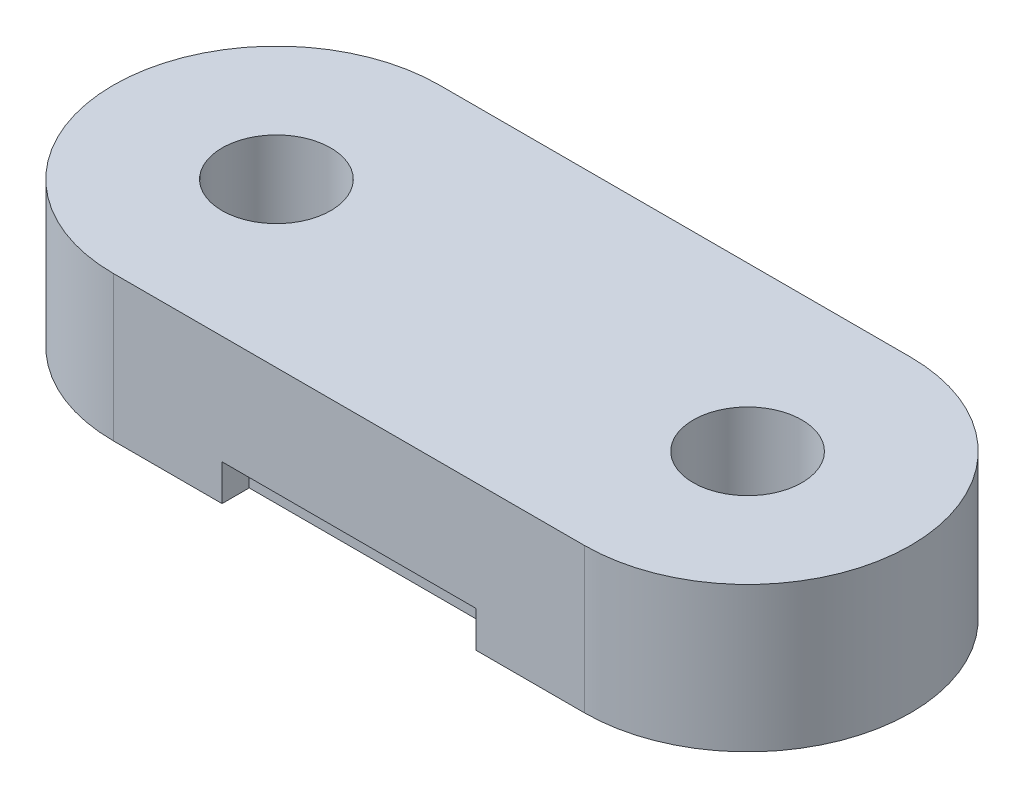
ISO-10303-21;
HEADER;
FILE_DESCRIPTION(('STEP AP214'),'2;1');
FILE_NAME('part.step','',(''),(''),'','','');
FILE_SCHEMA(('AUTOMOTIVE_DESIGN { 1 0 10303 214 1 1 1 1 }'));
ENDSEC;
DATA;
#1=APPLICATION_CONTEXT('core data for automotive mechanical design processes');
#2=APPLICATION_PROTOCOL_DEFINITION('international standard','automotive_design',2000,#1);
#3=PRODUCT_CONTEXT('',#1,'mechanical');
#4=PRODUCT('Part','Part','',(#3));
#5=PRODUCT_RELATED_PRODUCT_CATEGORY('part','',(#4));
#6=PRODUCT_DEFINITION_FORMATION('','',#4);
#7=PRODUCT_DEFINITION_CONTEXT('part definition',#1,'design');
#8=PRODUCT_DEFINITION('design','',#6,#7);
#9=PRODUCT_DEFINITION_SHAPE('','',#8);
#10=(LENGTH_UNIT() NAMED_UNIT(*) SI_UNIT(.MILLI.,.METRE.));
#11=(NAMED_UNIT(*) PLANE_ANGLE_UNIT() SI_UNIT($,.RADIAN.));
#12=(NAMED_UNIT(*) SI_UNIT($,.STERADIAN.) SOLID_ANGLE_UNIT());
#13=UNCERTAINTY_MEASURE_WITH_UNIT(LENGTH_MEASURE(1.E-05),#10,'distance_accuracy_value','');
#14=(GEOMETRIC_REPRESENTATION_CONTEXT(3) GLOBAL_UNCERTAINTY_ASSIGNED_CONTEXT((#13)) GLOBAL_UNIT_ASSIGNED_CONTEXT((#10,
#11,#12)) REPRESENTATION_CONTEXT('',''));
#15=CARTESIAN_POINT('',(0.,0.,0.));
#16=DIRECTION('',(0.,0.,1.));
#17=DIRECTION('',(1.,0.,0.));
#18=AXIS2_PLACEMENT_3D('',#15,#16,#17);
#19=CARTESIAN_POINT('',(-6.5,0.,0.));
#20=DIRECTION('',(0.,1.,0.));
#21=DIRECTION('',(0.,0.,1.));
#22=AXIS2_PLACEMENT_3D('',#19,#20,#21);
#23=PLANE('',#22);
#24=DIRECTION('',(1.,0.,0.));
#25=VECTOR('',#24,1.);
#26=CARTESIAN_POINT('',(0.,0.,3.75));
#27=LINE('',#26,#25);
#28=CARTESIAN_POINT('',(-3.5,0.,3.75));
#29=VERTEX_POINT('',#28);
#30=CARTESIAN_POINT('',(3.5,0.,3.75));
#31=VERTEX_POINT('',#30);
#32=EDGE_CURVE('E192',#29,#31,#27,.T.);
#33=ORIENTED_EDGE('',*,*,#32,.F.);
#34=DIRECTION('',(0.,0.,-1.));
#35=VECTOR('',#34,1.);
#36=CARTESIAN_POINT('',(-3.49999999999999,0.,-18.6299313016061));
#37=LINE('',#36,#35);
#38=CARTESIAN_POINT('',(-3.5,0.,4.5));
#39=VERTEX_POINT('',#38);
#40=EDGE_CURVE('E175',#39,#29,#37,.T.);
#41=ORIENTED_EDGE('',*,*,#40,.F.);
#42=DIRECTION('',(1.,0.,0.));
#43=VECTOR('',#42,1.);
#44=CARTESIAN_POINT('',(-6.5,0.,4.5));
#45=LINE('',#44,#43);
#46=CARTESIAN_POINT('',(-6.5,0.,4.5));
#47=VERTEX_POINT('',#46);
#48=EDGE_CURVE('E319',#47,#39,#45,.T.);
#49=ORIENTED_EDGE('',*,*,#48,.F.);
#50=CARTESIAN_POINT('',(-6.5,0.,0.));
#51=DIRECTION('',(0.,1.,0.));
#52=DIRECTION('',(0.,0.,1.));
#53=AXIS2_PLACEMENT_3D('',#50,#51,#52);
#54=CIRCLE('',#53,4.5);
#55=CARTESIAN_POINT('',(-6.5,0.,-4.5));
#56=VERTEX_POINT('',#55);
#57=EDGE_CURVE('E302',#56,#47,#54,.T.);
#58=ORIENTED_EDGE('',*,*,#57,.F.);
#59=DIRECTION('',(-1.,0.,0.));
#60=VECTOR('',#59,1.);
#61=CARTESIAN_POINT('',(-6.5,0.,-4.5));
#62=LINE('',#61,#60);
#63=CARTESIAN_POINT('',(-3.5,0.,-4.5));
#64=VERTEX_POINT('',#63);
#65=EDGE_CURVE('E324',#64,#56,#62,.T.);
#66=ORIENTED_EDGE('',*,*,#65,.F.);
#67=DIRECTION('',(0.,0.,-1.));
#68=VECTOR('',#67,1.);
#69=CARTESIAN_POINT('',(-3.49999999999999,0.,-18.6299313016061));
#70=LINE('',#69,#68);
#71=CARTESIAN_POINT('',(-3.5,0.,-3.75));
#72=VERTEX_POINT('',#71);
#73=EDGE_CURVE('E279',#72,#64,#70,.T.);
#74=ORIENTED_EDGE('',*,*,#73,.F.);
#75=DIRECTION('',(1.,0.,0.));
#76=VECTOR('',#75,1.);
#77=CARTESIAN_POINT('',(0.,0.,-3.75));
#78=LINE('',#77,#76);
#79=CARTESIAN_POINT('',(3.5,0.,-3.75));
#80=VERTEX_POINT('',#79);
#81=EDGE_CURVE('E258',#72,#80,#78,.T.);
#82=ORIENTED_EDGE('',*,*,#81,.T.);
#83=DIRECTION('',(0.,0.,-1.));
#84=VECTOR('',#83,1.);
#85=CARTESIAN_POINT('',(3.5,0.,-18.6299313016061));
#86=LINE('',#85,#84);
#87=CARTESIAN_POINT('',(3.5,0.,-4.5));
#88=VERTEX_POINT('',#87);
#89=EDGE_CURVE('E269',#80,#88,#86,.T.);
#90=ORIENTED_EDGE('',*,*,#89,.T.);
#91=CARTESIAN_POINT('',(6.5,0.,-4.5));
#92=VERTEX_POINT('',#91);
#93=EDGE_CURVE('E309',#92,#88,#62,.T.);
#94=ORIENTED_EDGE('',*,*,#93,.F.);
#95=CARTESIAN_POINT('',(6.5,0.,0.));
#96=DIRECTION('',(0.,1.,0.));
#97=DIRECTION('',(0.,0.,1.));
#98=AXIS2_PLACEMENT_3D('',#95,#96,#97);
#99=CIRCLE('',#98,4.5);
#100=CARTESIAN_POINT('',(6.5,0.,4.5));
#101=VERTEX_POINT('',#100);
#102=EDGE_CURVE('E322',#101,#92,#99,.T.);
#103=ORIENTED_EDGE('',*,*,#102,.F.);
#104=CARTESIAN_POINT('',(3.5,0.,4.5));
#105=VERTEX_POINT('',#104);
#106=EDGE_CURVE('E318',#105,#101,#45,.T.);
#107=ORIENTED_EDGE('',*,*,#106,.F.);
#108=DIRECTION('',(0.,0.,-1.));
#109=VECTOR('',#108,1.);
#110=CARTESIAN_POINT('',(3.5,0.,-18.6299313016061));
#111=LINE('',#110,#109);
#112=EDGE_CURVE('E189',#105,#31,#111,.T.);
#113=ORIENTED_EDGE('',*,*,#112,.T.);
#114=EDGE_LOOP('',(#33,#41,#49,#58,#66,#74,#82,#90,#94,#103,#107,#113));
#115=FACE_BOUND('',#114,.T.);
#116=CARTESIAN_POINT('',(6.5,0.,0.));
#117=DIRECTION('',(0.,1.,0.));
#118=DIRECTION('',(0.,0.,1.));
#119=AXIS2_PLACEMENT_3D('',#116,#117,#118);
#120=CIRCLE('',#119,1.5);
#121=CARTESIAN_POINT('',(6.5,0.,1.5));
#122=VERTEX_POINT('',#121);
#123=EDGE_CURVE('E296',#122,#122,#120,.T.);
#124=ORIENTED_EDGE('',*,*,#123,.T.);
#125=EDGE_LOOP('',(#124));
#126=FACE_BOUND('',#125,.T.);
#127=CARTESIAN_POINT('',(-6.5,0.,0.));
#128=DIRECTION('',(0.,1.,0.));
#129=DIRECTION('',(0.,0.,1.));
#130=AXIS2_PLACEMENT_3D('',#127,#128,#129);
#131=CIRCLE('',#130,1.5);
#132=CARTESIAN_POINT('',(-6.5,0.,1.5));
#133=VERTEX_POINT('',#132);
#134=EDGE_CURVE('E286',#133,#133,#131,.T.);
#135=ORIENTED_EDGE('',*,*,#134,.T.);
#136=EDGE_LOOP('',(#135));
#137=FACE_BOUND('',#136,.T.);
#138=DIRECTION('',(1.,0.,0.));
#139=VECTOR('',#138,1.);
#140=CARTESIAN_POINT('',(0.,0.,-2.25));
#141=LINE('',#140,#139);
#142=CARTESIAN_POINT('',(-3.5,0.,-2.25));
#143=VERTEX_POINT('',#142);
#144=CARTESIAN_POINT('',(3.5,0.,-2.25));
#145=VERTEX_POINT('',#144);
#146=EDGE_CURVE('E248',#143,#145,#141,.T.);
#147=ORIENTED_EDGE('',*,*,#146,.F.);
#148=DIRECTION('',(0.,0.,-1.));
#149=VECTOR('',#148,1.);
#150=CARTESIAN_POINT('',(-3.49999999999999,0.,-18.6299313016061));
#151=LINE('',#150,#149);
#152=CARTESIAN_POINT('',(-3.5,0.,-0.750000000000001));
#153=VERTEX_POINT('',#152);
#154=EDGE_CURVE('E229',#153,#143,#151,.T.);
#155=ORIENTED_EDGE('',*,*,#154,.F.);
#156=DIRECTION('',(1.,0.,0.));
#157=VECTOR('',#156,1.);
#158=CARTESIAN_POINT('',(0.,0.,-0.750000000000001));
#159=LINE('',#158,#157);
#160=CARTESIAN_POINT('',(3.5,0.,-0.750000000000001));
#161=VERTEX_POINT('',#160);
#162=EDGE_CURVE('E239',#153,#161,#159,.T.);
#163=ORIENTED_EDGE('',*,*,#162,.T.);
#164=DIRECTION('',(0.,0.,-1.));
#165=VECTOR('',#164,1.);
#166=CARTESIAN_POINT('',(3.5,0.,-18.6299313016061));
#167=LINE('',#166,#165);
#168=EDGE_CURVE('E251',#161,#145,#167,.T.);
#169=ORIENTED_EDGE('',*,*,#168,.T.);
#170=EDGE_LOOP('',(#147,#155,#163,#169));
#171=FACE_BOUND('',#170,.T.);
#172=DIRECTION('',(1.,0.,0.));
#173=VECTOR('',#172,1.);
#174=CARTESIAN_POINT('',(0.,0.,2.25));
#175=LINE('',#174,#173);
#176=CARTESIAN_POINT('',(-3.5,0.,2.25));
#177=VERTEX_POINT('',#176);
#178=CARTESIAN_POINT('',(3.5,0.,2.25));
#179=VERTEX_POINT('',#178);
#180=EDGE_CURVE('E54',#177,#179,#175,.T.);
#181=ORIENTED_EDGE('',*,*,#180,.T.);
#182=DIRECTION('',(0.,0.,-1.));
#183=VECTOR('',#182,1.);
#184=CARTESIAN_POINT('',(3.5,0.,-18.6299313016061));
#185=LINE('',#184,#183);
#186=CARTESIAN_POINT('',(3.5,0.,0.750000000000001));
#187=VERTEX_POINT('',#186);
#188=EDGE_CURVE('E209',#179,#187,#185,.T.);
#189=ORIENTED_EDGE('',*,*,#188,.T.);
#190=DIRECTION('',(1.,0.,0.));
#191=VECTOR('',#190,1.);
#192=CARTESIAN_POINT('',(0.,0.,0.750000000000001));
#193=LINE('',#192,#191);
#194=CARTESIAN_POINT('',(-3.5,0.,0.750000000000001));
#195=VERTEX_POINT('',#194);
#196=EDGE_CURVE('E222',#195,#187,#193,.T.);
#197=ORIENTED_EDGE('',*,*,#196,.F.);
#198=DIRECTION('',(0.,0.,-1.));
#199=VECTOR('',#198,1.);
#200=CARTESIAN_POINT('',(-3.49999999999999,0.,-18.6299313016061));
#201=LINE('',#200,#199);
#202=EDGE_CURVE('E219',#177,#195,#201,.T.);
#203=ORIENTED_EDGE('',*,*,#202,.F.);
#204=EDGE_LOOP('',(#181,#189,#197,#203));
#205=FACE_BOUND('',#204,.T.);
#206=ADVANCED_FACE('F31',(#115,#126,#137,#171,#205),#23,.F.);
#207=CARTESIAN_POINT('',(-6.5,4.,-4.5));
#208=DIRECTION('',(0.,0.,1.));
#209=DIRECTION('',(1.,0.,0.));
#210=AXIS2_PLACEMENT_3D('',#207,#208,#209);
#211=PLANE('',#210);
#212=DIRECTION('',(0.,-1.,0.));
#213=VECTOR('',#212,1.);
#214=CARTESIAN_POINT('',(3.5,1.,-4.5));
#215=LINE('',#214,#213);
#216=CARTESIAN_POINT('',(3.5,1.,-4.5));
#217=VERTEX_POINT('',#216);
#218=EDGE_CURVE('E287',#217,#88,#215,.T.);
#219=ORIENTED_EDGE('',*,*,#218,.F.);
#220=DIRECTION('',(1.,0.,0.));
#221=VECTOR('',#220,1.);
#222=CARTESIAN_POINT('',(0.,1.,-4.5));
#223=LINE('',#222,#221);
#224=CARTESIAN_POINT('',(-3.5,1.,-4.5));
#225=VERTEX_POINT('',#224);
#226=EDGE_CURVE('E271',#225,#217,#223,.T.);
#227=ORIENTED_EDGE('',*,*,#226,.F.);
#228=DIRECTION('',(0.,-1.,0.));
#229=VECTOR('',#228,1.);
#230=CARTESIAN_POINT('',(-3.5,1.,-4.5));
#231=LINE('',#230,#229);
#232=EDGE_CURVE('E289',#225,#64,#231,.T.);
#233=ORIENTED_EDGE('',*,*,#232,.T.);
#234=ORIENTED_EDGE('',*,*,#65,.T.);
#235=DIRECTION('',(0.,-1.,0.));
#236=VECTOR('',#235,1.);
#237=CARTESIAN_POINT('',(-6.5,4.,-4.5));
#238=LINE('',#237,#236);
#239=CARTESIAN_POINT('',(-6.5,4.,-4.5));
#240=VERTEX_POINT('',#239);
#241=EDGE_CURVE('E315',#240,#56,#238,.T.);
#242=ORIENTED_EDGE('',*,*,#241,.F.);
#243=DIRECTION('',(-1.,0.,0.));
#244=VECTOR('',#243,1.);
#245=CARTESIAN_POINT('',(-6.5,4.,-4.5));
#246=LINE('',#245,#244);
#247=CARTESIAN_POINT('',(6.5,4.,-4.5));
#248=VERTEX_POINT('',#247);
#249=EDGE_CURVE('E313',#248,#240,#246,.T.);
#250=ORIENTED_EDGE('',*,*,#249,.F.);
#251=DIRECTION('',(0.,-1.,0.));
#252=VECTOR('',#251,1.);
#253=CARTESIAN_POINT('',(6.5,4.,-4.5));
#254=LINE('',#253,#252);
#255=EDGE_CURVE('E329',#248,#92,#254,.T.);
#256=ORIENTED_EDGE('',*,*,#255,.T.);
#257=ORIENTED_EDGE('',*,*,#93,.T.);
#258=EDGE_LOOP('',(#219,#227,#233,#234,#242,#250,#256,#257));
#259=FACE_BOUND('',#258,.T.);
#260=ADVANCED_FACE('F345',(#259),#211,.F.);
#261=CARTESIAN_POINT('',(-6.5,4.,0.));
#262=DIRECTION('',(0.,1.,0.));
#263=DIRECTION('',(0.,0.,1.));
#264=AXIS2_PLACEMENT_3D('',#261,#262,#263);
#265=PLANE('',#264);
#266=CARTESIAN_POINT('',(6.5,4.,0.));
#267=DIRECTION('',(0.,1.,0.));
#268=DIRECTION('',(0.,0.,1.));
#269=AXIS2_PLACEMENT_3D('',#266,#267,#268);
#270=CIRCLE('',#269,1.5);
#271=CARTESIAN_POINT('',(6.5,4.,1.5));
#272=VERTEX_POINT('',#271);
#273=EDGE_CURVE('E299',#272,#272,#270,.T.);
#274=ORIENTED_EDGE('',*,*,#273,.F.);
#275=EDGE_LOOP('',(#274));
#276=FACE_BOUND('',#275,.T.);
#277=CARTESIAN_POINT('',(-6.5,4.,0.));
#278=DIRECTION('',(0.,1.,0.));
#279=DIRECTION('',(0.,0.,1.));
#280=AXIS2_PLACEMENT_3D('',#277,#278,#279);
#281=CIRCLE('',#280,4.5);
#282=CARTESIAN_POINT('',(-6.5,4.,4.5));
#283=VERTEX_POINT('',#282);
#284=EDGE_CURVE('E305',#240,#283,#281,.T.);
#285=ORIENTED_EDGE('',*,*,#284,.T.);
#286=DIRECTION('',(1.,0.,0.));
#287=VECTOR('',#286,1.);
#288=CARTESIAN_POINT('',(-6.5,4.,4.5));
#289=LINE('',#288,#287);
#290=CARTESIAN_POINT('',(6.5,4.,4.5));
#291=VERTEX_POINT('',#290);
#292=EDGE_CURVE('E308',#283,#291,#289,.T.);
#293=ORIENTED_EDGE('',*,*,#292,.T.);
#294=CARTESIAN_POINT('',(6.5,4.,0.));
#295=DIRECTION('',(0.,1.,0.));
#296=DIRECTION('',(0.,0.,1.));
#297=AXIS2_PLACEMENT_3D('',#294,#295,#296);
#298=CIRCLE('',#297,4.5);
#299=EDGE_CURVE('E311',#291,#248,#298,.T.);
#300=ORIENTED_EDGE('',*,*,#299,.T.);
#301=ORIENTED_EDGE('',*,*,#249,.T.);
#302=EDGE_LOOP('',(#285,#293,#300,#301));
#303=FACE_BOUND('',#302,.T.);
#304=CARTESIAN_POINT('',(-6.5,4.,0.));
#305=DIRECTION('',(0.,1.,0.));
#306=DIRECTION('',(0.,0.,1.));
#307=AXIS2_PLACEMENT_3D('',#304,#305,#306);
#308=CIRCLE('',#307,1.5);
#309=CARTESIAN_POINT('',(-6.5,4.,1.5));
#310=VERTEX_POINT('',#309);
#311=EDGE_CURVE('E293',#310,#310,#308,.T.);
#312=ORIENTED_EDGE('',*,*,#311,.F.);
#313=EDGE_LOOP('',(#312));
#314=FACE_BOUND('',#313,.T.);
#315=ADVANCED_FACE('F351',(#276,#303,#314),#265,.T.);
#316=CARTESIAN_POINT('',(-6.5,4.,0.));
#317=DIRECTION('',(0.,-1.,0.));
#318=DIRECTION('',(0.,0.,-1.));
#319=AXIS2_PLACEMENT_3D('',#316,#317,#318);
#320=CYLINDRICAL_SURFACE('',#319,4.5);
#321=ORIENTED_EDGE('',*,*,#57,.T.);
#322=DIRECTION('',(0.,-1.,0.));
#323=VECTOR('',#322,1.);
#324=CARTESIAN_POINT('',(-6.5,4.,4.5));
#325=LINE('',#324,#323);
#326=EDGE_CURVE('E11',#283,#47,#325,.T.);
#327=ORIENTED_EDGE('',*,*,#326,.F.);
#328=ORIENTED_EDGE('',*,*,#284,.F.);
#329=ORIENTED_EDGE('',*,*,#241,.T.);
#330=EDGE_LOOP('',(#321,#327,#328,#329));
#331=FACE_BOUND('',#330,.T.);
#332=ADVANCED_FACE('F33',(#331),#320,.T.);
#333=CARTESIAN_POINT('',(-6.5,4.,4.5));
#334=DIRECTION('',(0.,0.,-1.));
#335=DIRECTION('',(-1.,0.,0.));
#336=AXIS2_PLACEMENT_3D('',#333,#334,#335);
#337=PLANE('',#336);
#338=ORIENTED_EDGE('',*,*,#48,.T.);
#339=DIRECTION('',(0.,-1.,0.));
#340=VECTOR('',#339,1.);
#341=CARTESIAN_POINT('',(-3.5,1.,4.5));
#342=LINE('',#341,#340);
#343=CARTESIAN_POINT('',(-3.5,1.,4.5));
#344=VERTEX_POINT('',#343);
#345=EDGE_CURVE('E199',#344,#39,#342,.T.);
#346=ORIENTED_EDGE('',*,*,#345,.F.);
#347=DIRECTION('',(-1.,0.,0.));
#348=VECTOR('',#347,1.);
#349=CARTESIAN_POINT('',(0.,1.,4.5));
#350=LINE('',#349,#348);
#351=CARTESIAN_POINT('',(3.5,1.,4.5));
#352=VERTEX_POINT('',#351);
#353=EDGE_CURVE('E180',#352,#344,#350,.T.);
#354=ORIENTED_EDGE('',*,*,#353,.F.);
#355=DIRECTION('',(0.,-1.,0.));
#356=VECTOR('',#355,1.);
#357=CARTESIAN_POINT('',(3.5,1.,4.5));
#358=LINE('',#357,#356);
#359=EDGE_CURVE('E201',#352,#105,#358,.T.);
#360=ORIENTED_EDGE('',*,*,#359,.T.);
#361=ORIENTED_EDGE('',*,*,#106,.T.);
#362=DIRECTION('',(0.,-1.,0.));
#363=VECTOR('',#362,1.);
#364=CARTESIAN_POINT('',(6.5,4.,4.5));
#365=LINE('',#364,#363);
#366=EDGE_CURVE('E39',#291,#101,#365,.T.);
#367=ORIENTED_EDGE('',*,*,#366,.F.);
#368=ORIENTED_EDGE('',*,*,#292,.F.);
#369=ORIENTED_EDGE('',*,*,#326,.T.);
#370=EDGE_LOOP('',(#338,#346,#354,#360,#361,#367,#368,#369));
#371=FACE_BOUND('',#370,.T.);
#372=ADVANCED_FACE('F354',(#371),#337,.F.);
#373=CARTESIAN_POINT('',(6.5,4.,0.));
#374=DIRECTION('',(0.,-1.,0.));
#375=DIRECTION('',(0.,0.,-1.));
#376=AXIS2_PLACEMENT_3D('',#373,#374,#375);
#377=CYLINDRICAL_SURFACE('',#376,4.5);
#378=ORIENTED_EDGE('',*,*,#102,.T.);
#379=ORIENTED_EDGE('',*,*,#255,.F.);
#380=ORIENTED_EDGE('',*,*,#299,.F.);
#381=ORIENTED_EDGE('',*,*,#366,.T.);
#382=EDGE_LOOP('',(#378,#379,#380,#381));
#383=FACE_BOUND('',#382,.T.);
#384=ADVANCED_FACE('F336',(#383),#377,.T.);
#385=CARTESIAN_POINT('',(6.5,4.,0.));
#386=DIRECTION('',(0.,-1.,0.));
#387=DIRECTION('',(0.,0.,-1.));
#388=AXIS2_PLACEMENT_3D('',#385,#386,#387);
#389=CYLINDRICAL_SURFACE('',#388,1.5);
#390=ORIENTED_EDGE('',*,*,#273,.T.);
#391=EDGE_LOOP('',(#390));
#392=FACE_BOUND('',#391,.T.);
#393=ORIENTED_EDGE('',*,*,#123,.F.);
#394=EDGE_LOOP('',(#393));
#395=FACE_BOUND('',#394,.T.);
#396=ADVANCED_FACE('F381',(#392,#395),#389,.F.);
#397=CARTESIAN_POINT('',(-6.5,4.,0.));
#398=DIRECTION('',(0.,-1.,0.));
#399=DIRECTION('',(0.,0.,-1.));
#400=AXIS2_PLACEMENT_3D('',#397,#398,#399);
#401=CYLINDRICAL_SURFACE('',#400,1.5);
#402=ORIENTED_EDGE('',*,*,#311,.T.);
#403=EDGE_LOOP('',(#402));
#404=FACE_BOUND('',#403,.T.);
#405=ORIENTED_EDGE('',*,*,#134,.F.);
#406=EDGE_LOOP('',(#405));
#407=FACE_BOUND('',#406,.T.);
#408=ADVANCED_FACE('F396',(#404,#407),#401,.F.);
#409=CARTESIAN_POINT('',(0.,1.,-3.75));
#410=DIRECTION('',(0.,0.,-1.));
#411=DIRECTION('',(-1.,0.,0.));
#412=AXIS2_PLACEMENT_3D('',#409,#410,#411);
#413=PLANE('',#412);
#414=ORIENTED_EDGE('',*,*,#81,.F.);
#415=DIRECTION('',(0.,-1.,0.));
#416=VECTOR('',#415,1.);
#417=CARTESIAN_POINT('',(-3.5,1.,-3.75));
#418=LINE('',#417,#416);
#419=CARTESIAN_POINT('',(-3.5,1.,-3.75));
#420=VERTEX_POINT('',#419);
#421=EDGE_CURVE('E276',#420,#72,#418,.T.);
#422=ORIENTED_EDGE('',*,*,#421,.F.);
#423=DIRECTION('',(1.,0.,0.));
#424=VECTOR('',#423,1.);
#425=CARTESIAN_POINT('',(0.,1.,-3.75));
#426=LINE('',#425,#424);
#427=CARTESIAN_POINT('',(3.5,1.,-3.75));
#428=VERTEX_POINT('',#427);
#429=EDGE_CURVE('E265',#420,#428,#426,.T.);
#430=ORIENTED_EDGE('',*,*,#429,.T.);
#431=DIRECTION('',(0.,-1.,0.));
#432=VECTOR('',#431,1.);
#433=CARTESIAN_POINT('',(3.5,1.,-3.75));
#434=LINE('',#433,#432);
#435=EDGE_CURVE('E283',#428,#80,#434,.T.);
#436=ORIENTED_EDGE('',*,*,#435,.T.);
#437=EDGE_LOOP('',(#414,#422,#430,#436));
#438=FACE_BOUND('',#437,.T.);
#439=ADVANCED_FACE('F459',(#438),#413,.T.);
#440=CARTESIAN_POINT('',(3.5,1.,-18.6299313016061));
#441=DIRECTION('',(-1.,0.,0.));
#442=DIRECTION('',(0.,0.,1.));
#443=AXIS2_PLACEMENT_3D('',#440,#441,#442);
#444=PLANE('',#443);
#445=ORIENTED_EDGE('',*,*,#89,.F.);
#446=ORIENTED_EDGE('',*,*,#435,.F.);
#447=DIRECTION('',(0.,0.,-1.));
#448=VECTOR('',#447,1.);
#449=CARTESIAN_POINT('',(3.5,1.,-18.6299313016061));
#450=LINE('',#449,#448);
#451=EDGE_CURVE('E274',#428,#217,#450,.T.);
#452=ORIENTED_EDGE('',*,*,#451,.T.);
#453=ORIENTED_EDGE('',*,*,#218,.T.);
#454=EDGE_LOOP('',(#445,#446,#452,#453));
#455=FACE_BOUND('',#454,.T.);
#456=ADVANCED_FACE('F456',(#455),#444,.T.);
#457=CARTESIAN_POINT('',(-3.49999999999999,1.,-18.6299313016061));
#458=DIRECTION('',(-1.,0.,0.));
#459=DIRECTION('',(0.,0.,1.));
#460=AXIS2_PLACEMENT_3D('',#457,#458,#459);
#461=PLANE('',#460);
#462=ORIENTED_EDGE('',*,*,#73,.T.);
#463=ORIENTED_EDGE('',*,*,#232,.F.);
#464=DIRECTION('',(0.,0.,-1.));
#465=VECTOR('',#464,1.);
#466=CARTESIAN_POINT('',(-3.49999999999999,1.,-18.6299313016061));
#467=LINE('',#466,#465);
#468=EDGE_CURVE('E268',#420,#225,#467,.T.);
#469=ORIENTED_EDGE('',*,*,#468,.F.);
#470=ORIENTED_EDGE('',*,*,#421,.T.);
#471=EDGE_LOOP('',(#462,#463,#469,#470));
#472=FACE_BOUND('',#471,.T.);
#473=ADVANCED_FACE('F454',(#472),#461,.F.);
#474=CARTESIAN_POINT('',(0.,1.,-18.6299313016061));
#475=DIRECTION('',(0.,-1.,0.));
#476=DIRECTION('',(0.,0.,-1.));
#477=AXIS2_PLACEMENT_3D('',#474,#475,#476);
#478=PLANE('',#477);
#479=ORIENTED_EDGE('',*,*,#429,.F.);
#480=ORIENTED_EDGE('',*,*,#468,.T.);
#481=ORIENTED_EDGE('',*,*,#226,.T.);
#482=ORIENTED_EDGE('',*,*,#451,.F.);
#483=EDGE_LOOP('',(#479,#480,#481,#482));
#484=FACE_BOUND('',#483,.T.);
#485=ADVANCED_FACE('F450',(#484),#478,.T.);
#486=CARTESIAN_POINT('',(-3.49999999999999,1.,-18.6299313016061));
#487=DIRECTION('',(-1.,0.,0.));
#488=DIRECTION('',(0.,0.,1.));
#489=AXIS2_PLACEMENT_3D('',#486,#487,#488);
#490=PLANE('',#489);
#491=ORIENTED_EDGE('',*,*,#154,.T.);
#492=DIRECTION('',(0.,-1.,0.));
#493=VECTOR('',#492,1.);
#494=CARTESIAN_POINT('',(-3.5,1.,-2.25));
#495=LINE('',#494,#493);
#496=CARTESIAN_POINT('',(-3.5,1.,-2.25));
#497=VERTEX_POINT('',#496);
#498=EDGE_CURVE('E246',#497,#143,#495,.T.);
#499=ORIENTED_EDGE('',*,*,#498,.F.);
#500=DIRECTION('',(0.,0.,-1.));
#501=VECTOR('',#500,1.);
#502=CARTESIAN_POINT('',(-3.49999999999999,1.,-18.6299313016061));
#503=LINE('',#502,#501);
#504=CARTESIAN_POINT('',(-3.5,1.,-0.750000000000001));
#505=VERTEX_POINT('',#504);
#506=EDGE_CURVE('E235',#505,#497,#503,.T.);
#507=ORIENTED_EDGE('',*,*,#506,.F.);
#508=DIRECTION('',(0.,-1.,0.));
#509=VECTOR('',#508,1.);
#510=CARTESIAN_POINT('',(-3.5,1.,-0.750000000000001));
#511=LINE('',#510,#509);
#512=EDGE_CURVE('E256',#505,#153,#511,.T.);
#513=ORIENTED_EDGE('',*,*,#512,.T.);
#514=EDGE_LOOP('',(#491,#499,#507,#513));
#515=FACE_BOUND('',#514,.T.);
#516=ADVANCED_FACE('F440',(#515),#490,.F.);
#517=CARTESIAN_POINT('',(0.,1.,-0.750000000000001));
#518=DIRECTION('',(0.,0.,-1.));
#519=DIRECTION('',(-1.,0.,0.));
#520=AXIS2_PLACEMENT_3D('',#517,#518,#519);
#521=PLANE('',#520);
#522=ORIENTED_EDGE('',*,*,#162,.F.);
#523=ORIENTED_EDGE('',*,*,#512,.F.);
#524=DIRECTION('',(1.,0.,0.));
#525=VECTOR('',#524,1.);
#526=CARTESIAN_POINT('',(0.,1.,-0.750000000000001));
#527=LINE('',#526,#525);
#528=CARTESIAN_POINT('',(3.5,1.,-0.750000000000001));
#529=VERTEX_POINT('',#528);
#530=EDGE_CURVE('E244',#505,#529,#527,.T.);
#531=ORIENTED_EDGE('',*,*,#530,.T.);
#532=DIRECTION('',(0.,-1.,0.));
#533=VECTOR('',#532,1.);
#534=CARTESIAN_POINT('',(3.5,1.,-0.750000000000001));
#535=LINE('',#534,#533);
#536=EDGE_CURVE('E259',#529,#161,#535,.T.);
#537=ORIENTED_EDGE('',*,*,#536,.T.);
#538=EDGE_LOOP('',(#522,#523,#531,#537));
#539=FACE_BOUND('',#538,.T.);
#540=ADVANCED_FACE('F436',(#539),#521,.T.);
#541=CARTESIAN_POINT('',(3.5,1.,-18.6299313016061));
#542=DIRECTION('',(-1.,0.,0.));
#543=DIRECTION('',(0.,0.,1.));
#544=AXIS2_PLACEMENT_3D('',#541,#542,#543);
#545=PLANE('',#544);
#546=ORIENTED_EDGE('',*,*,#168,.F.);
#547=ORIENTED_EDGE('',*,*,#536,.F.);
#548=DIRECTION('',(0.,0.,-1.));
#549=VECTOR('',#548,1.);
#550=CARTESIAN_POINT('',(3.5,1.,-18.6299313016061));
#551=LINE('',#550,#549);
#552=CARTESIAN_POINT('',(3.5,1.,-2.25));
#553=VERTEX_POINT('',#552);
#554=EDGE_CURVE('E242',#529,#553,#551,.T.);
#555=ORIENTED_EDGE('',*,*,#554,.T.);
#556=DIRECTION('',(0.,-1.,0.));
#557=VECTOR('',#556,1.);
#558=CARTESIAN_POINT('',(3.5,1.,-2.25));
#559=LINE('',#558,#557);
#560=EDGE_CURVE('E261',#553,#145,#559,.T.);
#561=ORIENTED_EDGE('',*,*,#560,.T.);
#562=EDGE_LOOP('',(#546,#547,#555,#561));
#563=FACE_BOUND('',#562,.T.);
#564=ADVANCED_FACE('F439',(#563),#545,.T.);
#565=CARTESIAN_POINT('',(0.,1.,-2.25));
#566=DIRECTION('',(0.,0.,-1.));
#567=DIRECTION('',(-1.,0.,0.));
#568=AXIS2_PLACEMENT_3D('',#565,#566,#567);
#569=PLANE('',#568);
#570=ORIENTED_EDGE('',*,*,#146,.T.);
#571=ORIENTED_EDGE('',*,*,#560,.F.);
#572=DIRECTION('',(1.,0.,0.));
#573=VECTOR('',#572,1.);
#574=CARTESIAN_POINT('',(0.,1.,-2.25));
#575=LINE('',#574,#573);
#576=EDGE_CURVE('E238',#497,#553,#575,.T.);
#577=ORIENTED_EDGE('',*,*,#576,.F.);
#578=ORIENTED_EDGE('',*,*,#498,.T.);
#579=EDGE_LOOP('',(#570,#571,#577,#578));
#580=FACE_BOUND('',#579,.T.);
#581=ADVANCED_FACE('F434',(#580),#569,.F.);
#582=CARTESIAN_POINT('',(0.,1.,-18.6299313016061));
#583=DIRECTION('',(0.,-1.,0.));
#584=DIRECTION('',(0.,0.,-1.));
#585=AXIS2_PLACEMENT_3D('',#582,#583,#584);
#586=PLANE('',#585);
#587=ORIENTED_EDGE('',*,*,#506,.T.);
#588=ORIENTED_EDGE('',*,*,#576,.T.);
#589=ORIENTED_EDGE('',*,*,#554,.F.);
#590=ORIENTED_EDGE('',*,*,#530,.F.);
#591=EDGE_LOOP('',(#587,#588,#589,#590));
#592=FACE_BOUND('',#591,.T.);
#593=ADVANCED_FACE('F431',(#592),#586,.T.);
#594=CARTESIAN_POINT('',(0.,1.,2.25));
#595=DIRECTION('',(0.,0.,-1.));
#596=DIRECTION('',(-1.,0.,0.));
#597=AXIS2_PLACEMENT_3D('',#594,#595,#596);
#598=PLANE('',#597);
#599=ORIENTED_EDGE('',*,*,#180,.F.);
#600=DIRECTION('',(0.,-1.,0.));
#601=VECTOR('',#600,1.);
#602=CARTESIAN_POINT('',(-3.5,1.,2.25));
#603=LINE('',#602,#601);
#604=CARTESIAN_POINT('',(-3.5,1.,2.25));
#605=VERTEX_POINT('',#604);
#606=EDGE_CURVE('E217',#605,#177,#603,.T.);
#607=ORIENTED_EDGE('',*,*,#606,.F.);
#608=DIRECTION('',(1.,0.,0.));
#609=VECTOR('',#608,1.);
#610=CARTESIAN_POINT('',(0.,1.,2.25));
#611=LINE('',#610,#609);
#612=CARTESIAN_POINT('',(3.5,1.,2.25));
#613=VERTEX_POINT('',#612);
#614=EDGE_CURVE('E205',#605,#613,#611,.T.);
#615=ORIENTED_EDGE('',*,*,#614,.T.);
#616=DIRECTION('',(0.,-1.,0.));
#617=VECTOR('',#616,1.);
#618=CARTESIAN_POINT('',(3.5,1.,2.25));
#619=LINE('',#618,#617);
#620=EDGE_CURVE('E227',#613,#179,#619,.T.);
#621=ORIENTED_EDGE('',*,*,#620,.T.);
#622=EDGE_LOOP('',(#599,#607,#615,#621));
#623=FACE_BOUND('',#622,.T.);
#624=ADVANCED_FACE('F411',(#623),#598,.T.);
#625=CARTESIAN_POINT('',(3.5,1.,-18.6299313016061));
#626=DIRECTION('',(-1.,0.,0.));
#627=DIRECTION('',(0.,0.,1.));
#628=AXIS2_PLACEMENT_3D('',#625,#626,#627);
#629=PLANE('',#628);
#630=ORIENTED_EDGE('',*,*,#188,.F.);
#631=ORIENTED_EDGE('',*,*,#620,.F.);
#632=DIRECTION('',(0.,0.,-1.));
#633=VECTOR('',#632,1.);
#634=CARTESIAN_POINT('',(3.5,1.,-18.6299313016061));
#635=LINE('',#634,#633);
#636=CARTESIAN_POINT('',(3.5,1.,0.750000000000001));
#637=VERTEX_POINT('',#636);
#638=EDGE_CURVE('E215',#613,#637,#635,.T.);
#639=ORIENTED_EDGE('',*,*,#638,.T.);
#640=DIRECTION('',(0.,-1.,0.));
#641=VECTOR('',#640,1.);
#642=CARTESIAN_POINT('',(3.5,1.,0.750000000000001));
#643=LINE('',#642,#641);
#644=EDGE_CURVE('E230',#637,#187,#643,.T.);
#645=ORIENTED_EDGE('',*,*,#644,.T.);
#646=EDGE_LOOP('',(#630,#631,#639,#645));
#647=FACE_BOUND('',#646,.T.);
#648=ADVANCED_FACE('F416',(#647),#629,.T.);
#649=CARTESIAN_POINT('',(0.,1.,0.750000000000001));
#650=DIRECTION('',(0.,0.,-1.));
#651=DIRECTION('',(-1.,0.,0.));
#652=AXIS2_PLACEMENT_3D('',#649,#650,#651);
#653=PLANE('',#652);
#654=ORIENTED_EDGE('',*,*,#196,.T.);
#655=ORIENTED_EDGE('',*,*,#644,.F.);
#656=DIRECTION('',(1.,0.,0.));
#657=VECTOR('',#656,1.);
#658=CARTESIAN_POINT('',(0.,1.,0.750000000000001));
#659=LINE('',#658,#657);
#660=CARTESIAN_POINT('',(-3.5,1.,0.750000000000001));
#661=VERTEX_POINT('',#660);
#662=EDGE_CURVE('E212',#661,#637,#659,.T.);
#663=ORIENTED_EDGE('',*,*,#662,.F.);
#664=DIRECTION('',(0.,-1.,0.));
#665=VECTOR('',#664,1.);
#666=CARTESIAN_POINT('',(-3.5,1.,0.750000000000001));
#667=LINE('',#666,#665);
#668=EDGE_CURVE('E232',#661,#195,#667,.T.);
#669=ORIENTED_EDGE('',*,*,#668,.T.);
#670=EDGE_LOOP('',(#654,#655,#663,#669));
#671=FACE_BOUND('',#670,.T.);
#672=ADVANCED_FACE('F418',(#671),#653,.F.);
#673=CARTESIAN_POINT('',(-3.49999999999999,1.,-18.6299313016061));
#674=DIRECTION('',(-1.,0.,0.));
#675=DIRECTION('',(0.,0.,1.));
#676=AXIS2_PLACEMENT_3D('',#673,#674,#675);
#677=PLANE('',#676);
#678=ORIENTED_EDGE('',*,*,#202,.T.);
#679=ORIENTED_EDGE('',*,*,#668,.F.);
#680=DIRECTION('',(0.,0.,-1.));
#681=VECTOR('',#680,1.);
#682=CARTESIAN_POINT('',(-3.49999999999999,1.,-18.6299313016061));
#683=LINE('',#682,#681);
#684=EDGE_CURVE('E208',#605,#661,#683,.T.);
#685=ORIENTED_EDGE('',*,*,#684,.F.);
#686=ORIENTED_EDGE('',*,*,#606,.T.);
#687=EDGE_LOOP('',(#678,#679,#685,#686));
#688=FACE_BOUND('',#687,.T.);
#689=ADVANCED_FACE('F407',(#688),#677,.F.);
#690=CARTESIAN_POINT('',(0.,1.,-18.6299313016061));
#691=DIRECTION('',(0.,-1.,0.));
#692=DIRECTION('',(0.,0.,-1.));
#693=AXIS2_PLACEMENT_3D('',#690,#691,#692);
#694=PLANE('',#693);
#695=ORIENTED_EDGE('',*,*,#614,.F.);
#696=ORIENTED_EDGE('',*,*,#684,.T.);
#697=ORIENTED_EDGE('',*,*,#662,.T.);
#698=ORIENTED_EDGE('',*,*,#638,.F.);
#699=EDGE_LOOP('',(#695,#696,#697,#698));
#700=FACE_BOUND('',#699,.T.);
#701=ADVANCED_FACE('F368',(#700),#694,.T.);
#702=CARTESIAN_POINT('',(-3.49999999999999,1.,-18.6299313016061));
#703=DIRECTION('',(-1.,0.,0.));
#704=DIRECTION('',(0.,0.,1.));
#705=AXIS2_PLACEMENT_3D('',#702,#703,#704);
#706=PLANE('',#705);
#707=ORIENTED_EDGE('',*,*,#40,.T.);
#708=DIRECTION('',(0.,-1.,0.));
#709=VECTOR('',#708,1.);
#710=CARTESIAN_POINT('',(-3.5,1.,3.75));
#711=LINE('',#710,#709);
#712=CARTESIAN_POINT('',(-3.5,1.,3.75));
#713=VERTEX_POINT('',#712);
#714=EDGE_CURVE('E169',#713,#29,#711,.T.);
#715=ORIENTED_EDGE('',*,*,#714,.F.);
#716=DIRECTION('',(0.,0.,-1.));
#717=VECTOR('',#716,1.);
#718=CARTESIAN_POINT('',(-3.49999999999999,1.,-18.6299313016061));
#719=LINE('',#718,#717);
#720=EDGE_CURVE('E173',#344,#713,#719,.T.);
#721=ORIENTED_EDGE('',*,*,#720,.F.);
#722=ORIENTED_EDGE('',*,*,#345,.T.);
#723=EDGE_LOOP('',(#707,#715,#721,#722));
#724=FACE_BOUND('',#723,.T.);
#725=ADVANCED_FACE('F171',(#724),#706,.F.);
#726=CARTESIAN_POINT('',(3.5,1.,-18.6299313016061));
#727=DIRECTION('',(-1.,0.,0.));
#728=DIRECTION('',(0.,0.,1.));
#729=AXIS2_PLACEMENT_3D('',#726,#727,#728);
#730=PLANE('',#729);
#731=ORIENTED_EDGE('',*,*,#112,.F.);
#732=ORIENTED_EDGE('',*,*,#359,.F.);
#733=DIRECTION('',(0.,0.,-1.));
#734=VECTOR('',#733,1.);
#735=CARTESIAN_POINT('',(3.5,1.,-18.6299313016061));
#736=LINE('',#735,#734);
#737=CARTESIAN_POINT('',(3.5,1.,3.75));
#738=VERTEX_POINT('',#737);
#739=EDGE_CURVE('E46',#352,#738,#736,.T.);
#740=ORIENTED_EDGE('',*,*,#739,.T.);
#741=DIRECTION('',(0.,-1.,0.));
#742=VECTOR('',#741,1.);
#743=CARTESIAN_POINT('',(3.5,1.,3.75));
#744=LINE('',#743,#742);
#745=EDGE_CURVE('E179',#738,#31,#744,.T.);
#746=ORIENTED_EDGE('',*,*,#745,.T.);
#747=EDGE_LOOP('',(#731,#732,#740,#746));
#748=FACE_BOUND('',#747,.T.);
#749=ADVANCED_FACE('F360',(#748),#730,.T.);
#750=CARTESIAN_POINT('',(0.,1.,3.75));
#751=DIRECTION('',(0.,0.,-1.));
#752=DIRECTION('',(-1.,0.,0.));
#753=AXIS2_PLACEMENT_3D('',#750,#751,#752);
#754=PLANE('',#753);
#755=ORIENTED_EDGE('',*,*,#32,.T.);
#756=ORIENTED_EDGE('',*,*,#745,.F.);
#757=DIRECTION('',(1.,0.,0.));
#758=VECTOR('',#757,1.);
#759=CARTESIAN_POINT('',(0.,1.,3.75));
#760=LINE('',#759,#758);
#761=EDGE_CURVE('E183',#713,#738,#760,.T.);
#762=ORIENTED_EDGE('',*,*,#761,.F.);
#763=ORIENTED_EDGE('',*,*,#714,.T.);
#764=EDGE_LOOP('',(#755,#756,#762,#763));
#765=FACE_BOUND('',#764,.T.);
#766=ADVANCED_FACE('F184',(#765),#754,.F.);
#767=CARTESIAN_POINT('',(0.,1.,-18.6299313016061));
#768=DIRECTION('',(0.,-1.,0.));
#769=DIRECTION('',(0.,0.,-1.));
#770=AXIS2_PLACEMENT_3D('',#767,#768,#769);
#771=PLANE('',#770);
#772=ORIENTED_EDGE('',*,*,#720,.T.);
#773=ORIENTED_EDGE('',*,*,#761,.T.);
#774=ORIENTED_EDGE('',*,*,#739,.F.);
#775=ORIENTED_EDGE('',*,*,#353,.T.);
#776=EDGE_LOOP('',(#772,#773,#774,#775));
#777=FACE_BOUND('',#776,.T.);
#778=ADVANCED_FACE('F186',(#777),#771,.T.);
#779=CLOSED_SHELL('',(#206,#260,#315,#332,#372,#384,#396,#408,#439,#456,#473,#485,#516,#540,
#564,#581,#593,#624,#648,#672,#689,#701,#725,#749,#766,#778));
#780=MANIFOLD_SOLID_BREP('B2',#779);
#781=ADVANCED_BREP_SHAPE_REPRESENTATION('',(#18,#780),#14);
#782=SHAPE_DEFINITION_REPRESENTATION(#9,#781);
ENDSEC;
END-ISO-10303-21;
